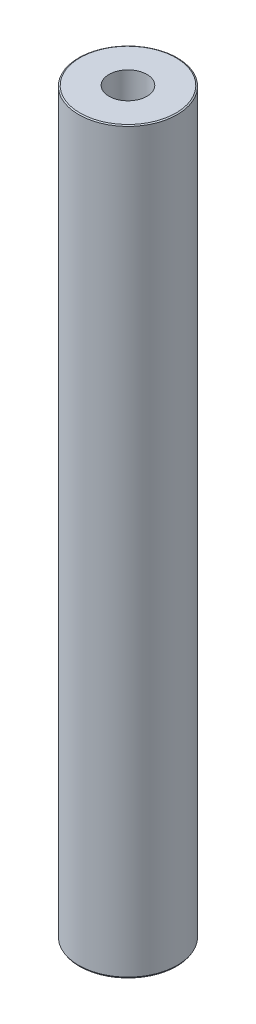
ISO-10303-21;
HEADER;
FILE_DESCRIPTION(('STEP AP214'),'2;1');
FILE_NAME('part.step','',(''),(''),'','','');
FILE_SCHEMA(('AUTOMOTIVE_DESIGN { 1 0 10303 214 1 1 1 1 }'));
ENDSEC;
DATA;
#1=APPLICATION_CONTEXT('core data for automotive mechanical design processes');
#2=APPLICATION_PROTOCOL_DEFINITION('international standard','automotive_design',2000,#1);
#3=PRODUCT_CONTEXT('',#1,'mechanical');
#4=PRODUCT('Part','Part','',(#3));
#5=PRODUCT_RELATED_PRODUCT_CATEGORY('part','',(#4));
#6=PRODUCT_DEFINITION_FORMATION('','',#4);
#7=PRODUCT_DEFINITION_CONTEXT('part definition',#1,'design');
#8=PRODUCT_DEFINITION('design','',#6,#7);
#9=PRODUCT_DEFINITION_SHAPE('','',#8);
#10=(LENGTH_UNIT() NAMED_UNIT(*) SI_UNIT(.MILLI.,.METRE.));
#11=(NAMED_UNIT(*) PLANE_ANGLE_UNIT() SI_UNIT($,.RADIAN.));
#12=(NAMED_UNIT(*) SI_UNIT($,.STERADIAN.) SOLID_ANGLE_UNIT());
#13=UNCERTAINTY_MEASURE_WITH_UNIT(LENGTH_MEASURE(1.E-05),#10,'distance_accuracy_value','');
#14=(GEOMETRIC_REPRESENTATION_CONTEXT(3) GLOBAL_UNCERTAINTY_ASSIGNED_CONTEXT((#13)) GLOBAL_UNIT_ASSIGNED_CONTEXT((#10,
#11,#12)) REPRESENTATION_CONTEXT('',''));
#15=CARTESIAN_POINT('',(0.,0.,0.));
#16=DIRECTION('',(0.,0.,1.));
#17=DIRECTION('',(1.,0.,0.));
#18=AXIS2_PLACEMENT_3D('',#15,#16,#17);
#19=CARTESIAN_POINT('',(0.,600.,0.));
#20=DIRECTION('',(0.,-1.,0.));
#21=DIRECTION('',(0.,0.,-1.));
#22=AXIS2_PLACEMENT_3D('',#19,#20,#21);
#23=CYLINDRICAL_SURFACE('',#22,40.);
#24=CARTESIAN_POINT('',(0.,599.396275717989,0.));
#25=DIRECTION('',(0.,1.,0.));
#26=DIRECTION('',(0.,0.,1.));
#27=AXIS2_PLACEMENT_3D('',#24,#25,#26);
#28=CIRCLE('',#27,40.);
#29=CARTESIAN_POINT('',(0.,599.396275717989,40.));
#30=VERTEX_POINT('',#29);
#31=EDGE_CURVE('E50',#30,#30,#28,.F.);
#32=ORIENTED_EDGE('',*,*,#31,.T.);
#33=EDGE_LOOP('',(#32));
#34=FACE_BOUND('',#33,.T.);
#35=CARTESIAN_POINT('',(0.,1.04568113020553,0.));
#36=DIRECTION('',(0.,1.,0.));
#37=DIRECTION('',(0.,0.,1.));
#38=AXIS2_PLACEMENT_3D('',#35,#36,#37);
#39=CIRCLE('',#38,40.);
#40=CARTESIAN_POINT('',(0.,1.04568113020553,40.));
#41=VERTEX_POINT('',#40);
#42=EDGE_CURVE('E51',#41,#41,#39,.T.);
#43=ORIENTED_EDGE('',*,*,#42,.T.);
#44=EDGE_LOOP('',(#43));
#45=FACE_BOUND('',#44,.T.);
#46=ADVANCED_FACE('F39',(#34,#45),#23,.T.);
#47=CARTESIAN_POINT('',(0.,600.,0.));
#48=DIRECTION('',(0.,1.,0.));
#49=DIRECTION('',(0.,0.,1.));
#50=AXIS2_PLACEMENT_3D('',#47,#48,#49);
#51=PLANE('',#50);
#52=CARTESIAN_POINT('',(0.,600.,0.));
#53=DIRECTION('',(0.,1.,0.));
#54=DIRECTION('',(0.,0.,1.));
#55=AXIS2_PLACEMENT_3D('',#52,#53,#54);
#56=CIRCLE('',#55,38.9543188697945);
#57=CARTESIAN_POINT('',(0.,600.,38.9543188697945));
#58=VERTEX_POINT('',#57);
#59=EDGE_CURVE('E54',#58,#58,#56,.T.);
#60=ORIENTED_EDGE('',*,*,#59,.T.);
#61=EDGE_LOOP('',(#60));
#62=FACE_BOUND('',#61,.T.);
#63=CARTESIAN_POINT('',(0.,600.,0.));
#64=DIRECTION('',(0.,1.,0.));
#65=DIRECTION('',(0.,0.,1.));
#66=AXIS2_PLACEMENT_3D('',#63,#64,#65);
#67=CIRCLE('',#66,15.4167672501744);
#68=CARTESIAN_POINT('',(0.,600.,15.4167672501744));
#69=VERTEX_POINT('',#68);
#70=EDGE_CURVE('E58',#69,#69,#67,.T.);
#71=ORIENTED_EDGE('',*,*,#70,.F.);
#72=EDGE_LOOP('',(#71));
#73=FACE_BOUND('',#72,.T.);
#74=ADVANCED_FACE('F69',(#62,#73),#51,.T.);
#75=CARTESIAN_POINT('',(0.,0.,0.));
#76=DIRECTION('',(0.,1.,0.));
#77=DIRECTION('',(0.,0.,1.));
#78=AXIS2_PLACEMENT_3D('',#75,#76,#77);
#79=PLANE('',#78);
#80=CARTESIAN_POINT('',(0.,0.,0.));
#81=DIRECTION('',(0.,1.,0.));
#82=DIRECTION('',(0.,0.,1.));
#83=AXIS2_PLACEMENT_3D('',#80,#81,#82);
#84=CIRCLE('',#83,39.3962757179893);
#85=CARTESIAN_POINT('',(0.,0.,39.3962757179893));
#86=VERTEX_POINT('',#85);
#87=EDGE_CURVE('E10',#86,#86,#84,.F.);
#88=ORIENTED_EDGE('',*,*,#87,.T.);
#89=EDGE_LOOP('',(#88));
#90=FACE_BOUND('',#89,.T.);
#91=CARTESIAN_POINT('',(0.,0.,0.));
#92=DIRECTION('',(0.,1.,0.));
#93=DIRECTION('',(0.,0.,1.));
#94=AXIS2_PLACEMENT_3D('',#91,#92,#93);
#95=CIRCLE('',#94,15.4167672501744);
#96=CARTESIAN_POINT('',(0.,0.,15.4167672501744));
#97=VERTEX_POINT('',#96);
#98=EDGE_CURVE('E63',#97,#97,#95,.T.);
#99=ORIENTED_EDGE('',*,*,#98,.T.);
#100=EDGE_LOOP('',(#99));
#101=FACE_BOUND('',#100,.T.);
#102=ADVANCED_FACE('F75',(#90,#101),#79,.F.);
#103=CARTESIAN_POINT('',(0.,600.,0.));
#104=DIRECTION('',(0.,-1.,0.));
#105=DIRECTION('',(0.,0.,-1.));
#106=AXIS2_PLACEMENT_3D('',#103,#104,#105);
#107=CYLINDRICAL_SURFACE('',#106,15.4167672501744);
#108=ORIENTED_EDGE('',*,*,#70,.T.);
#109=EDGE_LOOP('',(#108));
#110=FACE_BOUND('',#109,.T.);
#111=ORIENTED_EDGE('',*,*,#98,.F.);
#112=EDGE_LOOP('',(#111));
#113=FACE_BOUND('',#112,.T.);
#114=ADVANCED_FACE('F70',(#110,#113),#107,.F.);
#115=CARTESIAN_POINT('',(0.,600.,0.));
#116=DIRECTION('',(0.,-1.,0.));
#117=DIRECTION('',(0.,0.,-1.));
#118=AXIS2_PLACEMENT_3D('',#115,#116,#117);
#119=CONICAL_SURFACE('',#118,38.9543188697945,1.04719755119663);
#120=ORIENTED_EDGE('',*,*,#31,.F.);
#121=EDGE_LOOP('',(#120));
#122=FACE_BOUND('',#121,.T.);
#123=ORIENTED_EDGE('',*,*,#59,.F.);
#124=EDGE_LOOP('',(#123));
#125=FACE_BOUND('',#124,.T.);
#126=ADVANCED_FACE('F81',(#122,#125),#119,.T.);
#127=CARTESIAN_POINT('',(0.,1.04568113020553,0.));
#128=DIRECTION('',(0.,1.,0.));
#129=DIRECTION('',(0.,0.,1.));
#130=AXIS2_PLACEMENT_3D('',#127,#128,#129);
#131=CONICAL_SURFACE('',#130,40.,0.523598775598305);
#132=ORIENTED_EDGE('',*,*,#87,.F.);
#133=EDGE_LOOP('',(#132));
#134=FACE_BOUND('',#133,.T.);
#135=ORIENTED_EDGE('',*,*,#42,.F.);
#136=EDGE_LOOP('',(#135));
#137=FACE_BOUND('',#136,.T.);
#138=ADVANCED_FACE('F45',(#134,#137),#131,.T.);
#139=CLOSED_SHELL('',(#46,#74,#102,#114,#126,#138));
#140=MANIFOLD_SOLID_BREP('B2',#139);
#141=ADVANCED_BREP_SHAPE_REPRESENTATION('',(#18,#140),#14);
#142=SHAPE_DEFINITION_REPRESENTATION(#9,#141);
ENDSEC;
END-ISO-10303-21;
